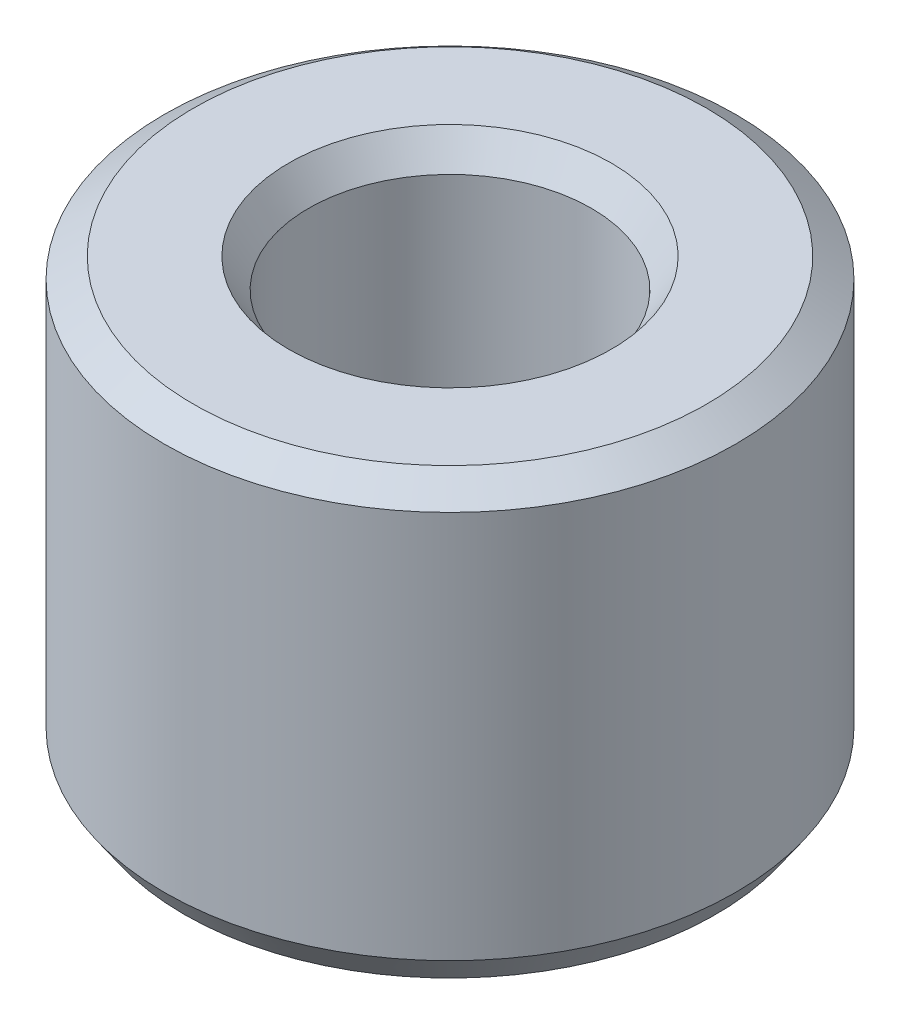
ISO-10303-21;
HEADER;
FILE_DESCRIPTION(('STEP AP214'),'2;1');
FILE_NAME('part.step','',(''),(''),'','','');
FILE_SCHEMA(('AUTOMOTIVE_DESIGN { 1 0 10303 214 1 1 1 1 }'));
ENDSEC;
DATA;
#1=APPLICATION_CONTEXT('core data for automotive mechanical design processes');
#2=APPLICATION_PROTOCOL_DEFINITION('international standard','automotive_design',2000,#1);
#3=PRODUCT_CONTEXT('',#1,'mechanical');
#4=PRODUCT('Part','Part','',(#3));
#5=PRODUCT_RELATED_PRODUCT_CATEGORY('part','',(#4));
#6=PRODUCT_DEFINITION_FORMATION('','',#4);
#7=PRODUCT_DEFINITION_CONTEXT('part definition',#1,'design');
#8=PRODUCT_DEFINITION('design','',#6,#7);
#9=PRODUCT_DEFINITION_SHAPE('','',#8);
#10=(LENGTH_UNIT() NAMED_UNIT(*) SI_UNIT(.MILLI.,.METRE.));
#11=(NAMED_UNIT(*) PLANE_ANGLE_UNIT() SI_UNIT($,.RADIAN.));
#12=(NAMED_UNIT(*) SI_UNIT($,.STERADIAN.) SOLID_ANGLE_UNIT());
#13=UNCERTAINTY_MEASURE_WITH_UNIT(LENGTH_MEASURE(1.E-05),#10,'distance_accuracy_value','');
#14=(GEOMETRIC_REPRESENTATION_CONTEXT(3) GLOBAL_UNCERTAINTY_ASSIGNED_CONTEXT((#13)) GLOBAL_UNIT_ASSIGNED_CONTEXT((#10,
#11,#12)) REPRESENTATION_CONTEXT('',''));
#15=CARTESIAN_POINT('',(0.,0.,0.));
#16=DIRECTION('',(0.,0.,1.));
#17=DIRECTION('',(1.,0.,0.));
#18=AXIS2_PLACEMENT_3D('',#15,#16,#17);
#19=CARTESIAN_POINT('',(0.,76.5486682922534,0.));
#20=DIRECTION('',(0.,-1.,0.));
#21=DIRECTION('',(0.,0.,-1.));
#22=AXIS2_PLACEMENT_3D('',#19,#20,#21);
#23=CYLINDRICAL_SURFACE('',#22,50.);
#24=CARTESIAN_POINT('',(0.,5.10041477076359,0.));
#25=DIRECTION('',(0.,1.,0.));
#26=DIRECTION('',(0.,0.,1.));
#27=AXIS2_PLACEMENT_3D('',#24,#25,#26);
#28=CIRCLE('',#27,50.);
#29=CARTESIAN_POINT('',(0.,5.10041477076359,50.));
#30=VERTEX_POINT('',#29);
#31=EDGE_CURVE('E10',#30,#30,#28,.T.);
#32=ORIENTED_EDGE('',*,*,#31,.T.);
#33=EDGE_LOOP('',(#32));
#34=FACE_BOUND('',#33,.T.);
#35=CARTESIAN_POINT('',(0.,73.0543188173778,0.));
#36=DIRECTION('',(0.,1.,0.));
#37=DIRECTION('',(0.,0.,1.));
#38=AXIS2_PLACEMENT_3D('',#35,#36,#37);
#39=CIRCLE('',#38,50.);
#40=CARTESIAN_POINT('',(0.,73.0543188173778,-50.));
#41=VERTEX_POINT('',#40);
#42=EDGE_CURVE('E50',#41,#41,#39,.F.);
#43=ORIENTED_EDGE('',*,*,#42,.T.);
#44=EDGE_LOOP('',(#43));
#45=FACE_BOUND('',#44,.T.);
#46=ADVANCED_FACE('F39',(#34,#45),#23,.T.);
#47=CARTESIAN_POINT('',(0.,76.5486682922534,0.));
#48=DIRECTION('',(0.,1.,0.));
#49=DIRECTION('',(0.,0.,1.));
#50=AXIS2_PLACEMENT_3D('',#47,#48,#49);
#51=PLANE('',#50);
#52=CARTESIAN_POINT('',(0.,76.5486682922534,0.));
#53=DIRECTION('',(0.,1.,0.));
#54=DIRECTION('',(0.,0.,1.));
#55=AXIS2_PLACEMENT_3D('',#52,#53,#54);
#56=CIRCLE('',#55,28.2407322624154);
#57=CARTESIAN_POINT('',(0.,76.5486682922534,28.2407322624154));
#58=VERTEX_POINT('',#57);
#59=EDGE_CURVE('E58',#58,#58,#56,.F.);
#60=ORIENTED_EDGE('',*,*,#59,.T.);
#61=EDGE_LOOP('',(#60));
#62=FACE_BOUND('',#61,.T.);
#63=CARTESIAN_POINT('',(0.,76.5486682922534,0.));
#64=DIRECTION('',(0.,1.,0.));
#65=DIRECTION('',(0.,0.,1.));
#66=AXIS2_PLACEMENT_3D('',#63,#64,#65);
#67=CIRCLE('',#66,44.8995852292364);
#68=CARTESIAN_POINT('',(0.,76.5486682922534,-44.8995852292364));
#69=VERTEX_POINT('',#68);
#70=EDGE_CURVE('E61',#69,#69,#67,.T.);
#71=ORIENTED_EDGE('',*,*,#70,.T.);
#72=EDGE_LOOP('',(#71));
#73=FACE_BOUND('',#72,.T.);
#74=ADVANCED_FACE('F88',(#62,#73),#51,.T.);
#75=CARTESIAN_POINT('',(0.,0.,0.));
#76=DIRECTION('',(0.,1.,0.));
#77=DIRECTION('',(0.,0.,1.));
#78=AXIS2_PLACEMENT_3D('',#75,#76,#77);
#79=PLANE('',#78);
#80=CARTESIAN_POINT('',(0.,0.,0.));
#81=DIRECTION('',(0.,1.,0.));
#82=DIRECTION('',(0.,0.,1.));
#83=AXIS2_PLACEMENT_3D('',#80,#81,#82);
#84=CIRCLE('',#83,29.8467975583034);
#85=CARTESIAN_POINT('',(0.,0.,-29.8467975583034));
#86=VERTEX_POINT('',#85);
#87=EDGE_CURVE('E51',#86,#86,#84,.T.);
#88=ORIENTED_EDGE('',*,*,#87,.T.);
#89=EDGE_LOOP('',(#88));
#90=FACE_BOUND('',#89,.T.);
#91=CARTESIAN_POINT('',(0.,0.,0.));
#92=DIRECTION('',(0.,1.,0.));
#93=DIRECTION('',(0.,0.,1.));
#94=AXIS2_PLACEMENT_3D('',#91,#92,#93);
#95=CIRCLE('',#94,46.5056505251244);
#96=CARTESIAN_POINT('',(0.,0.,46.5056505251244));
#97=VERTEX_POINT('',#96);
#98=EDGE_CURVE('E54',#97,#97,#95,.F.);
#99=ORIENTED_EDGE('',*,*,#98,.T.);
#100=EDGE_LOOP('',(#99));
#101=FACE_BOUND('',#100,.T.);
#102=ADVANCED_FACE('F83',(#90,#101),#79,.F.);
#103=CARTESIAN_POINT('',(0.,76.5486682922534,0.));
#104=DIRECTION('',(0.,-1.,0.));
#105=DIRECTION('',(0.,0.,-1.));
#106=AXIS2_PLACEMENT_3D('',#103,#104,#105);
#107=CYLINDRICAL_SURFACE('',#106,24.7463827875398);
#108=CARTESIAN_POINT('',(0.,71.4482535214899,0.));
#109=DIRECTION('',(0.,1.,0.));
#110=DIRECTION('',(0.,0.,1.));
#111=AXIS2_PLACEMENT_3D('',#108,#109,#110);
#112=CIRCLE('',#111,24.7463827875398);
#113=CARTESIAN_POINT('',(0.,71.4482535214899,24.7463827875398));
#114=VERTEX_POINT('',#113);
#115=EDGE_CURVE('E67',#114,#114,#112,.T.);
#116=ORIENTED_EDGE('',*,*,#115,.T.);
#117=EDGE_LOOP('',(#116));
#118=FACE_BOUND('',#117,.T.);
#119=CARTESIAN_POINT('',(0.,3.49434947487562,0.));
#120=DIRECTION('',(0.,1.,0.));
#121=DIRECTION('',(0.,0.,1.));
#122=AXIS2_PLACEMENT_3D('',#119,#120,#121);
#123=CIRCLE('',#122,24.7463827875398);
#124=CARTESIAN_POINT('',(0.,3.49434947487562,-24.7463827875398));
#125=VERTEX_POINT('',#124);
#126=EDGE_CURVE('E69',#125,#125,#123,.F.);
#127=ORIENTED_EDGE('',*,*,#126,.T.);
#128=EDGE_LOOP('',(#127));
#129=FACE_BOUND('',#128,.T.);
#130=ADVANCED_FACE('F71',(#118,#129),#107,.F.);
#131=CARTESIAN_POINT('',(0.,71.4482535214899,0.));
#132=DIRECTION('',(0.,1.,0.));
#133=DIRECTION('',(0.,0.,1.));
#134=AXIS2_PLACEMENT_3D('',#131,#132,#133);
#135=CONICAL_SURFACE('',#134,24.7463827875398,0.600663192254252);
#136=ORIENTED_EDGE('',*,*,#59,.F.);
#137=EDGE_LOOP('',(#136));
#138=FACE_BOUND('',#137,.T.);
#139=ORIENTED_EDGE('',*,*,#115,.F.);
#140=EDGE_LOOP('',(#139));
#141=FACE_BOUND('',#140,.T.);
#142=ADVANCED_FACE('F77',(#138,#141),#135,.F.);
#143=CARTESIAN_POINT('',(0.,0.,0.));
#144=DIRECTION('',(0.,-1.,0.));
#145=DIRECTION('',(0.,0.,-1.));
#146=AXIS2_PLACEMENT_3D('',#143,#144,#145);
#147=CONICAL_SURFACE('',#146,29.8467975583034,0.970133134540645);
#148=CARTESIAN_POINT('',(0.,3.49434947487562,-24.7463827875398));
#149=CARTESIAN_POINT('',(0.,3.457950001179,-24.7995121080686));
#150=CARTESIAN_POINT('',(0.,3.42155052748238,-24.8526414285974));
#151=CARTESIAN_POINT('',(0.,3.34875158008913,-24.958900069655));
#152=CARTESIAN_POINT('',(0.,3.31235210639251,-25.0120293901838));
#153=CARTESIAN_POINT('',(0.,3.23955315899927,-25.1182880312413));
#154=CARTESIAN_POINT('',(0.,3.20315368530265,-25.1714173517701));
#155=CARTESIAN_POINT('',(0.,3.13035473790941,-25.2776759928277));
#156=CARTESIAN_POINT('',(0.,3.09395526421279,-25.3308053133565));
#157=CARTESIAN_POINT('',(0.,3.02115631681955,-25.4370639544141));
#158=CARTESIAN_POINT('',(0.,2.98475684312292,-25.4901932749429));
#159=CARTESIAN_POINT('',(0.,2.91195789572968,-25.5964519160004));
#160=CARTESIAN_POINT('',(0.,2.87555842203306,-25.6495812365292));
#161=CARTESIAN_POINT('',(0.,2.80275947463982,-25.7558398775868));
#162=CARTESIAN_POINT('',(0.,2.7663600009432,-25.8089691981156));
#163=CARTESIAN_POINT('',(0.,2.69356105354996,-25.9152278391732));
#164=CARTESIAN_POINT('',(0.,2.65716157985334,-25.9683571597019));
#165=CARTESIAN_POINT('',(0.,2.58436263246009,-26.0746158007595));
#166=CARTESIAN_POINT('',(0.,2.54796315876347,-26.1277451212883));
#167=CARTESIAN_POINT('',(0.,2.47516421137023,-26.2340037623459));
#168=CARTESIAN_POINT('',(0.,2.43876473767361,-26.2871330828747));
#169=CARTESIAN_POINT('',(0.,2.36596579028037,-26.3933917239322));
#170=CARTESIAN_POINT('',(0.,2.32956631658375,-26.446521044461));
#171=CARTESIAN_POINT('',(0.,2.2567673691905,-26.5527796855186));
#172=CARTESIAN_POINT('',(0.,2.22036789549388,-26.6059090060474));
#173=CARTESIAN_POINT('',(0.,2.14756894810064,-26.712167647105));
#174=CARTESIAN_POINT('',(0.,2.11116947440402,-26.7652969676337));
#175=CARTESIAN_POINT('',(0.,2.03837052701078,-26.8715556086913));
#176=CARTESIAN_POINT('',(0.,2.00197105331416,-26.9246849292201));
#177=CARTESIAN_POINT('',(0.,1.92917210592091,-27.0309435702777));
#178=CARTESIAN_POINT('',(0.,1.89277263222429,-27.0840728908065));
#179=CARTESIAN_POINT('',(0.,1.81997368483105,-27.190331531864));
#180=CARTESIAN_POINT('',(0.,1.78357421113443,-27.2434608523928));
#181=CARTESIAN_POINT('',(0.,1.71077526374119,-27.3497194934504));
#182=CARTESIAN_POINT('',(0.,1.67437579004457,-27.4028488139792));
#183=CARTESIAN_POINT('',(0.,1.60157684265133,-27.5091074550368));
#184=CARTESIAN_POINT('',(0.,1.5651773689547,-27.5622367755656));
#185=CARTESIAN_POINT('',(0.,1.49237842156146,-27.6684954166231));
#186=CARTESIAN_POINT('',(0.,1.45597894786484,-27.7216247371519));
#187=CARTESIAN_POINT('',(0.,1.3831800004716,-27.8278833782095));
#188=CARTESIAN_POINT('',(0.,1.34678052677498,-27.8810126987383));
#189=CARTESIAN_POINT('',(0.,1.27398157938174,-27.9872713397958));
#190=CARTESIAN_POINT('',(0.,1.23758210568512,-28.0404006603246));
#191=CARTESIAN_POINT('',(0.,1.16478315829187,-28.1466593013822));
#192=CARTESIAN_POINT('',(0.,1.12838368459525,-28.199788621911));
#193=CARTESIAN_POINT('',(0.,1.05558473720201,-28.3060472629686));
#194=CARTESIAN_POINT('',(0.,1.01918526350539,-28.3591765834974));
#195=CARTESIAN_POINT('',(0.,0.946386316112147,-28.4654352245549));
#196=CARTESIAN_POINT('',(0.,0.909986842415525,-28.5185645450837));
#197=CARTESIAN_POINT('',(0.,0.837187895022283,-28.6248231861413));
#198=CARTESIAN_POINT('',(0.,0.800788421325663,-28.6779525066701));
#199=CARTESIAN_POINT('',(0.,0.727989473932421,-28.7842111477277));
#200=CARTESIAN_POINT('',(0.,0.691590000235799,-28.8373404682564));
#201=CARTESIAN_POINT('',(0.,0.618791052842557,-28.943599109314));
#202=CARTESIAN_POINT('',(0.,0.582391579145937,-28.9967284298428));
#203=CARTESIAN_POINT('',(0.,0.509592631752695,-29.1029870709004));
#204=CARTESIAN_POINT('',(0.,0.473193158056073,-29.1561163914292));
#205=CARTESIAN_POINT('',(0.,0.400394210662831,-29.2623750324867));
#206=CARTESIAN_POINT('',(0.,0.36399473696621,-29.3155043530155));
#207=CARTESIAN_POINT('',(0.,0.291195789572968,-29.4217629940731));
#208=CARTESIAN_POINT('',(0.,0.254796315876347,-29.4748923146019));
#209=CARTESIAN_POINT('',(0.,0.181997368483105,-29.5811509556595));
#210=CARTESIAN_POINT('',(0.,0.145597894786484,-29.6342802761883));
#211=CARTESIAN_POINT('',(0.,0.0727989473932426,-29.7405389172458));
#212=CARTESIAN_POINT('',(0.,0.0363994736966219,-29.7936682377746));
#213=CARTESIAN_POINT('',(0.,0.,-29.8467975583034));
#214=B_SPLINE_CURVE_WITH_KNOTS('',3,(#148,#149,#150,#151,#152,#153,#154,#155,#156,#157,#158,
#159,#160,#161,#162,#163,#164,#165,#166,#167,#168,#169,#170,#171,#172,#173,#174,#175,#176,#177,
#178,#179,#180,#181,#182,#183,#184,#185,#186,#187,#188,#189,#190,#191,#192,#193,#194,#195,#196,
#197,#198,#199,#200,#201,#202,#203,#204,#205,#206,#207,#208,#209,#210,#211,#212,#213),
.UNSPECIFIED.,.F.,.F.,(4,2,2,2,2,2,2,2,2,2,2,2,2,2,2,2,2,2,2,2,2,2,2,2,2,2,2,2,2,2,2,2,4),(0.,
0.193206670348552,0.386413340697106,0.579620011045658,0.772826681394212,0.966033351742764,
1.15924002209132,1.35244669243987,1.54565336278842,1.73886003313698,1.93206670348553,
2.12527337383408,2.31848004418264,2.51168671453119,2.70489338487974,2.89810005522829,
3.09130672557685,3.2845133959254,3.47772006627395,3.67092673662251,3.86413340697106,
4.05734007731961,4.25054674766816,4.44375341801672,4.63696008836527,4.83016675871382,
5.02337342906237,5.21658009941093,5.40978676975948,5.60299344010804,5.79620011045659,
5.98940678080514,6.18261345115369),.UNSPECIFIED.);
#215=EDGE_CURVE('BSEAM73',#125,#86,#214,.T.);
#216=ORIENTED_EDGE('',*,*,#126,.F.);
#217=ORIENTED_EDGE('',*,*,#87,.F.);
#218=ORIENTED_EDGE('',*,*,#215,.T.);
#219=ORIENTED_EDGE('',*,*,#215,.F.);
#220=EDGE_LOOP('',(#216,#218,#217,#219));
#221=FACE_BOUND('',#220,.T.);
#222=ADVANCED_FACE('F73',(#221),#147,.F.);
#223=CARTESIAN_POINT('',(0.,5.10041477076359,0.));
#224=DIRECTION('',(0.,1.,0.));
#225=DIRECTION('',(0.,0.,1.));
#226=AXIS2_PLACEMENT_3D('',#223,#224,#225);
#227=CONICAL_SURFACE('',#226,50.,0.60066319225425);
#228=ORIENTED_EDGE('',*,*,#98,.F.);
#229=EDGE_LOOP('',(#228));
#230=FACE_BOUND('',#229,.T.);
#231=ORIENTED_EDGE('',*,*,#31,.F.);
#232=EDGE_LOOP('',(#231));
#233=FACE_BOUND('',#232,.T.);
#234=ADVANCED_FACE('F76',(#230,#233),#227,.T.);
#235=CARTESIAN_POINT('',(0.,76.5486682922534,0.));
#236=DIRECTION('',(0.,-1.,0.));
#237=DIRECTION('',(0.,0.,-1.));
#238=AXIS2_PLACEMENT_3D('',#235,#236,#237);
#239=CONICAL_SURFACE('',#238,44.8995852292364,0.970133134540645);
#240=CARTESIAN_POINT('',(0.,73.0543188173778,-50.));
#241=CARTESIAN_POINT('',(0.,73.0907182910744,-49.9468706794712));
#242=CARTESIAN_POINT('',(0.,73.127117764771,-49.8937413589424));
#243=CARTESIAN_POINT('',(0.,73.1999167121643,-49.7874827178849));
#244=CARTESIAN_POINT('',(0.,73.2363161858609,-49.7343533973561));
#245=CARTESIAN_POINT('',(0.,73.3091151332541,-49.6280947562985));
#246=CARTESIAN_POINT('',(0.,73.3455146069508,-49.5749654357697));
#247=CARTESIAN_POINT('',(0.,73.418313554344,-49.4687067947121));
#248=CARTESIAN_POINT('',(0.,73.4547130280406,-49.4155774741834));
#249=CARTESIAN_POINT('',(0.,73.5275119754339,-49.3093188331258));
#250=CARTESIAN_POINT('',(0.,73.5639114491305,-49.256189512597));
#251=CARTESIAN_POINT('',(0.,73.6367103965237,-49.1499308715394));
#252=CARTESIAN_POINT('',(0.,73.6731098702204,-49.0968015510106));
#253=CARTESIAN_POINT('',(0.,73.7459088176136,-48.990542909953));
#254=CARTESIAN_POINT('',(0.,73.7823082913102,-48.9374135894243));
#255=CARTESIAN_POINT('',(0.,73.8551072387035,-48.8311549483667));
#256=CARTESIAN_POINT('',(0.,73.8915067124001,-48.7780256278379));
#257=CARTESIAN_POINT('',(0.,73.9643056597933,-48.6717669867803));
#258=CARTESIAN_POINT('',(0.,74.00070513349,-48.6186376662515));
#259=CARTESIAN_POINT('',(0.,74.0735040808832,-48.512379025194));
#260=CARTESIAN_POINT('',(0.,74.1099035545798,-48.4592497046652));
#261=CARTESIAN_POINT('',(0.,74.1827025019731,-48.3529910636076));
#262=CARTESIAN_POINT('',(0.,74.2191019756697,-48.2998617430788));
#263=CARTESIAN_POINT('',(0.,74.2919009230629,-48.1936031020212));
#264=CARTESIAN_POINT('',(0.,74.3283003967595,-48.1404737814925));
#265=CARTESIAN_POINT('',(0.,74.4010993441528,-48.0342151404349));
#266=CARTESIAN_POINT('',(0.,74.4374988178494,-47.9810858199061));
#267=CARTESIAN_POINT('',(0.,74.5102977652426,-47.8748271788485));
#268=CARTESIAN_POINT('',(0.,74.5466972389393,-47.8216978583197));
#269=CARTESIAN_POINT('',(0.,74.6194961863325,-47.7154392172621));
#270=CARTESIAN_POINT('',(0.,74.6558956600291,-47.6623098967334));
#271=CARTESIAN_POINT('',(0.,74.7286946074224,-47.5560512556758));
#272=CARTESIAN_POINT('',(0.,74.765094081119,-47.502921935147));
#273=CARTESIAN_POINT('',(0.,74.8378930285122,-47.3966632940894));
#274=CARTESIAN_POINT('',(0.,74.8742925022089,-47.3435339735606));
#275=CARTESIAN_POINT('',(0.,74.9470914496021,-47.2372753325031));
#276=CARTESIAN_POINT('',(0.,74.9834909232987,-47.1841460119743));
#277=CARTESIAN_POINT('',(0.,75.056289870692,-47.0778873709167));
#278=CARTESIAN_POINT('',(0.,75.0926893443886,-47.0247580503879));
#279=CARTESIAN_POINT('',(0.,75.1654882917818,-46.9184994093303));
#280=CARTESIAN_POINT('',(0.,75.2018877654785,-46.8653700888016));
#281=CARTESIAN_POINT('',(0.,75.2746867128717,-46.759111447744));
#282=CARTESIAN_POINT('',(0.,75.3110861865683,-46.7059821272152));
#283=CARTESIAN_POINT('',(0.,75.3838851339615,-46.5997234861576));
#284=CARTESIAN_POINT('',(0.,75.4202846076582,-46.5465941656288));
#285=CARTESIAN_POINT('',(0.,75.4930835550514,-46.4403355245712));
#286=CARTESIAN_POINT('',(0.,75.529483028748,-46.3872062040425));
#287=CARTESIAN_POINT('',(0.,75.6022819761413,-46.2809475629849));
#288=CARTESIAN_POINT('',(0.,75.6386814498379,-46.2278182424561));
#289=CARTESIAN_POINT('',(0.,75.7114803972311,-46.1215596013985));
#290=CARTESIAN_POINT('',(0.,75.7478798709278,-46.0684302808697));
#291=CARTESIAN_POINT('',(0.,75.820678818321,-45.9621716398122));
#292=CARTESIAN_POINT('',(0.,75.8570782920176,-45.9090423192834));
#293=CARTESIAN_POINT('',(0.,75.9298772394109,-45.8027836782258));
#294=CARTESIAN_POINT('',(0.,75.9662767131075,-45.749654357697));
#295=CARTESIAN_POINT('',(0.,76.0390756605007,-45.6433957166394));
#296=CARTESIAN_POINT('',(0.,76.0754751341974,-45.5902663961106));
#297=CARTESIAN_POINT('',(0.,76.1482740815906,-45.4840077550531));
#298=CARTESIAN_POINT('',(0.,76.1846735552872,-45.4308784345243));
#299=CARTESIAN_POINT('',(0.,76.2574725026805,-45.3246197934667));
#300=CARTESIAN_POINT('',(0.,76.2938719763771,-45.2714904729379));
#301=CARTESIAN_POINT('',(0.,76.3666709237703,-45.1652318318803));
#302=CARTESIAN_POINT('',(0.,76.4030703974669,-45.1121025113516));
#303=CARTESIAN_POINT('',(0.,76.4758693448602,-45.005843870294));
#304=CARTESIAN_POINT('',(0.,76.5122688185568,-44.9527145497652));
#305=CARTESIAN_POINT('',(0.,76.5486682922534,-44.8995852292364));
#306=B_SPLINE_CURVE_WITH_KNOTS('',3,(#240,#241,#242,#243,#244,#245,#246,#247,#248,#249,#250,
#251,#252,#253,#254,#255,#256,#257,#258,#259,#260,#261,#262,#263,#264,#265,#266,#267,#268,#269,
#270,#271,#272,#273,#274,#275,#276,#277,#278,#279,#280,#281,#282,#283,#284,#285,#286,#287,#288,
#289,#290,#291,#292,#293,#294,#295,#296,#297,#298,#299,#300,#301,#302,#303,#304,#305),
.UNSPECIFIED.,.F.,.F.,(4,2,2,2,2,2,2,2,2,2,2,2,2,2,2,2,2,2,2,2,2,2,2,2,2,2,2,2,2,2,2,2,4),(0.,
0.193206670348548,0.386413340697102,0.579620011045656,0.77282668139421,0.966033351742764,
1.15924002209132,1.35244669243987,1.54565336278843,1.73886003313699,1.93206670348554,
2.1252733738341,2.31848004418265,2.5116867145312,2.70489338487976,2.89810005522831,
3.09130672557687,3.28451339592543,3.47772006627398,3.67092673662253,3.86413340697108,
4.05734007731964,4.25054674766819,4.44375341801675,4.63696008836531,4.83016675871386,
5.02337342906242,5.21658009941097,5.40978676975952,5.60299344010808,5.79620011045663,
5.98940678080519,6.18261345115375),.UNSPECIFIED.);
#307=EDGE_CURVE('BSEAM45',#41,#69,#306,.T.);
#308=ORIENTED_EDGE('',*,*,#42,.F.);
#309=ORIENTED_EDGE('',*,*,#70,.F.);
#310=ORIENTED_EDGE('',*,*,#307,.T.);
#311=ORIENTED_EDGE('',*,*,#307,.F.);
#312=EDGE_LOOP('',(#308,#310,#309,#311));
#313=FACE_BOUND('',#312,.T.);
#314=ADVANCED_FACE('F45',(#313),#239,.T.);
#315=CLOSED_SHELL('',(#46,#74,#102,#130,#142,#222,#234,#314));
#316=MANIFOLD_SOLID_BREP('B2',#315);
#317=ADVANCED_BREP_SHAPE_REPRESENTATION('',(#18,#316),#14);
#318=SHAPE_DEFINITION_REPRESENTATION(#9,#317);
ENDSEC;
END-ISO-10303-21;
